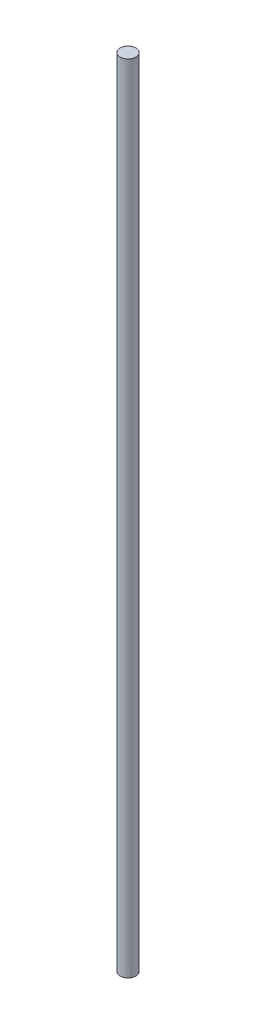
ISO-10303-21;
HEADER;
FILE_DESCRIPTION(('STEP AP214'),'2;1');
FILE_NAME('part.step','',(''),(''),'','','');
FILE_SCHEMA(('AUTOMOTIVE_DESIGN { 1 0 10303 214 1 1 1 1 }'));
ENDSEC;
DATA;
#1=APPLICATION_CONTEXT('core data for automotive mechanical design processes');
#2=APPLICATION_PROTOCOL_DEFINITION('international standard','automotive_design',2000,#1);
#3=PRODUCT_CONTEXT('',#1,'mechanical');
#4=PRODUCT('Part','Part','',(#3));
#5=PRODUCT_RELATED_PRODUCT_CATEGORY('part','',(#4));
#6=PRODUCT_DEFINITION_FORMATION('','',#4);
#7=PRODUCT_DEFINITION_CONTEXT('part definition',#1,'design');
#8=PRODUCT_DEFINITION('design','',#6,#7);
#9=PRODUCT_DEFINITION_SHAPE('','',#8);
#10=(LENGTH_UNIT() NAMED_UNIT(*) SI_UNIT(.MILLI.,.METRE.));
#11=(NAMED_UNIT(*) PLANE_ANGLE_UNIT() SI_UNIT($,.RADIAN.));
#12=(NAMED_UNIT(*) SI_UNIT($,.STERADIAN.) SOLID_ANGLE_UNIT());
#13=UNCERTAINTY_MEASURE_WITH_UNIT(LENGTH_MEASURE(1.E-05),#10,'distance_accuracy_value','');
#14=(GEOMETRIC_REPRESENTATION_CONTEXT(3) GLOBAL_UNCERTAINTY_ASSIGNED_CONTEXT((#13)) GLOBAL_UNIT_ASSIGNED_CONTEXT((#10,
#11,#12)) REPRESENTATION_CONTEXT('',''));
#15=CARTESIAN_POINT('',(0.,0.,0.));
#16=DIRECTION('',(0.,0.,1.));
#17=DIRECTION('',(1.,0.,0.));
#18=AXIS2_PLACEMENT_3D('',#15,#16,#17);
#19=CARTESIAN_POINT('',(0.,150.,0.));
#20=DIRECTION('',(0.,-1.,0.));
#21=DIRECTION('',(0.,0.,-1.));
#22=AXIS2_PLACEMENT_3D('',#19,#20,#21);
#23=CYLINDRICAL_SURFACE('',#22,1.5);
#24=CARTESIAN_POINT('',(0.,150.,0.));
#25=DIRECTION('',(0.,1.,0.));
#26=DIRECTION('',(0.,0.,1.));
#27=AXIS2_PLACEMENT_3D('',#24,#25,#26);
#28=CIRCLE('',#27,1.5);
#29=CARTESIAN_POINT('',(0.,150.,1.5));
#30=VERTEX_POINT('',#29);
#31=EDGE_CURVE('E10',#30,#30,#28,.T.);
#32=ORIENTED_EDGE('',*,*,#31,.F.);
#33=EDGE_LOOP('',(#32));
#34=FACE_BOUND('',#33,.T.);
#35=CARTESIAN_POINT('',(0.,0.,0.));
#36=DIRECTION('',(0.,1.,0.));
#37=DIRECTION('',(0.,0.,1.));
#38=AXIS2_PLACEMENT_3D('',#35,#36,#37);
#39=CIRCLE('',#38,1.5);
#40=CARTESIAN_POINT('',(0.,0.,1.5));
#41=VERTEX_POINT('',#40);
#42=EDGE_CURVE('E34',#41,#41,#39,.T.);
#43=ORIENTED_EDGE('',*,*,#42,.T.);
#44=EDGE_LOOP('',(#43));
#45=FACE_BOUND('',#44,.T.);
#46=ADVANCED_FACE('F31',(#34,#45),#23,.T.);
#47=CARTESIAN_POINT('',(0.,150.,0.));
#48=DIRECTION('',(0.,1.,0.));
#49=DIRECTION('',(0.,0.,1.));
#50=AXIS2_PLACEMENT_3D('',#47,#48,#49);
#51=PLANE('',#50);
#52=ORIENTED_EDGE('',*,*,#31,.T.);
#53=EDGE_LOOP('',(#52));
#54=FACE_BOUND('',#53,.T.);
#55=ADVANCED_FACE('F46',(#54),#51,.T.);
#56=CARTESIAN_POINT('',(0.,0.,0.));
#57=DIRECTION('',(0.,1.,0.));
#58=DIRECTION('',(0.,0.,1.));
#59=AXIS2_PLACEMENT_3D('',#56,#57,#58);
#60=PLANE('',#59);
#61=ORIENTED_EDGE('',*,*,#42,.F.);
#62=EDGE_LOOP('',(#61));
#63=FACE_BOUND('',#62,.T.);
#64=ADVANCED_FACE('F44',(#63),#60,.F.);
#65=CLOSED_SHELL('',(#46,#55,#64));
#66=MANIFOLD_SOLID_BREP('B2',#65);
#67=ADVANCED_BREP_SHAPE_REPRESENTATION('',(#18,#66),#14);
#68=SHAPE_DEFINITION_REPRESENTATION(#9,#67);
ENDSEC;
END-ISO-10303-21;
